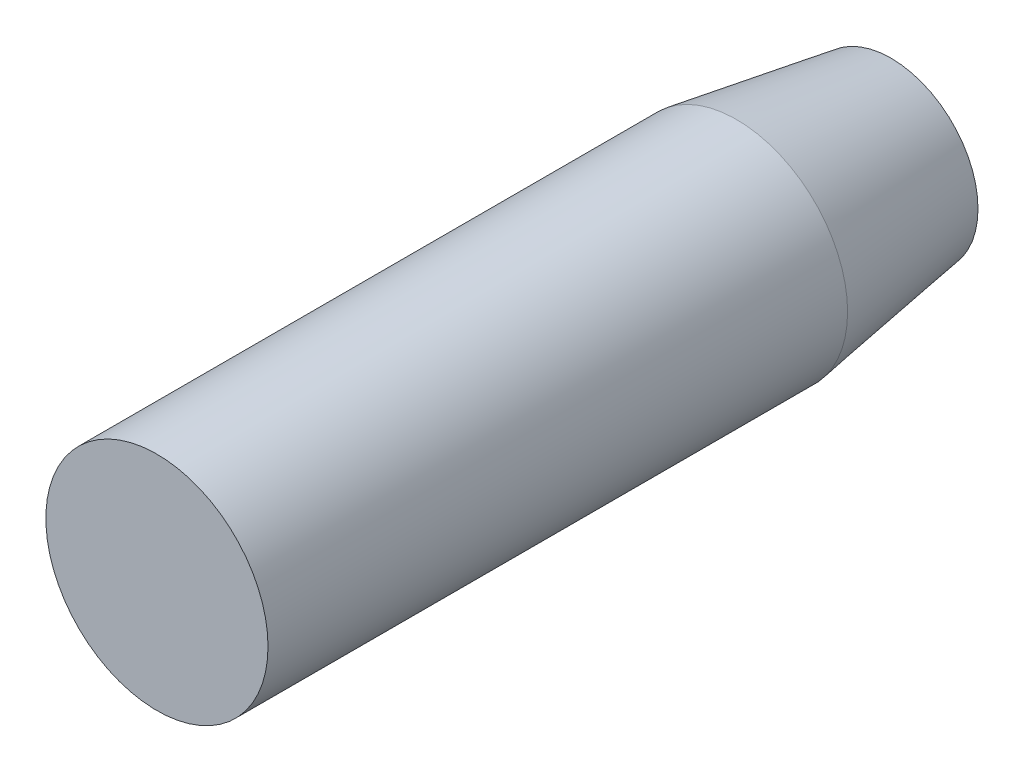
ISO-10303-21;
HEADER;
FILE_DESCRIPTION(('STEP AP214'),'2;1');
FILE_NAME('part.step','',(''),(''),'','','');
FILE_SCHEMA(('AUTOMOTIVE_DESIGN { 1 0 10303 214 1 1 1 1 }'));
ENDSEC;
DATA;
#1=APPLICATION_CONTEXT('core data for automotive mechanical design processes');
#2=APPLICATION_PROTOCOL_DEFINITION('international standard','automotive_design',2000,#1);
#3=PRODUCT_CONTEXT('',#1,'mechanical');
#4=PRODUCT('Part','Part','',(#3));
#5=PRODUCT_RELATED_PRODUCT_CATEGORY('part','',(#4));
#6=PRODUCT_DEFINITION_FORMATION('','',#4);
#7=PRODUCT_DEFINITION_CONTEXT('part definition',#1,'design');
#8=PRODUCT_DEFINITION('design','',#6,#7);
#9=PRODUCT_DEFINITION_SHAPE('','',#8);
#10=(LENGTH_UNIT() NAMED_UNIT(*) SI_UNIT(.MILLI.,.METRE.));
#11=(NAMED_UNIT(*) PLANE_ANGLE_UNIT() SI_UNIT($,.RADIAN.));
#12=(NAMED_UNIT(*) SI_UNIT($,.STERADIAN.) SOLID_ANGLE_UNIT());
#13=UNCERTAINTY_MEASURE_WITH_UNIT(LENGTH_MEASURE(1.E-05),#10,'distance_accuracy_value','');
#14=(GEOMETRIC_REPRESENTATION_CONTEXT(3) GLOBAL_UNCERTAINTY_ASSIGNED_CONTEXT((#13)) GLOBAL_UNIT_ASSIGNED_CONTEXT((#10,
#11,#12)) REPRESENTATION_CONTEXT('',''));
#15=CARTESIAN_POINT('',(0.,0.,0.));
#16=DIRECTION('',(0.,0.,1.));
#17=DIRECTION('',(1.,0.,0.));
#18=AXIS2_PLACEMENT_3D('',#15,#16,#17);
#19=CARTESIAN_POINT('',(-4.83870960531696,12.5960053959194,0.));
#20=DIRECTION('',(0.,0.,-1.));
#21=DIRECTION('',(-1.,0.,0.));
#22=AXIS2_PLACEMENT_3D('',#19,#20,#21);
#23=PLANE('',#22);
#24=CARTESIAN_POINT('',(-4.83870960531696,12.5960053959194,2.00880978518114E-12));
#25=DIRECTION('',(0.,0.,1.));
#26=DIRECTION('',(1.,0.,0.));
#27=AXIS2_PLACEMENT_3D('',#24,#25,#26);
#28=CIRCLE('',#27,14.2874999999872);
#29=CARTESIAN_POINT('',(9.44879039467024,12.5960053959194,2.00880978518114E-12));
#30=VERTEX_POINT('',#29);
#31=EDGE_CURVE('E18',#30,#30,#28,.T.);
#32=ORIENTED_EDGE('',*,*,#31,.F.);
#33=EDGE_LOOP('',(#32));
#34=FACE_BOUND('',#33,.T.);
#35=ADVANCED_FACE('F15',(#34),#23,.T.);
#36=CARTESIAN_POINT('',(-4.83870960531696,12.5960053959194,25.4));
#37=DIRECTION('',(0.,0.,1.));
#38=DIRECTION('',(1.,0.,0.));
#39=AXIS2_PLACEMENT_3D('',#36,#37,#38);
#40=CONICAL_SURFACE('',#39,18.25625,0.154996741924445);
#41=CARTESIAN_POINT('',(-4.83870960531696,12.5960053959194,25.4));
#42=DIRECTION('',(0.,0.,1.));
#43=DIRECTION('',(1.,0.,0.));
#44=AXIS2_PLACEMENT_3D('',#41,#42,#43);
#45=CIRCLE('',#44,18.25625);
#46=CARTESIAN_POINT('',(13.417540394683,12.5960053959194,25.4));
#47=VERTEX_POINT('',#46);
#48=EDGE_CURVE('E22',#47,#47,#45,.T.);
#49=ORIENTED_EDGE('',*,*,#48,.F.);
#50=EDGE_LOOP('',(#49));
#51=FACE_BOUND('',#50,.T.);
#52=ORIENTED_EDGE('',*,*,#31,.T.);
#53=EDGE_LOOP('',(#52));
#54=FACE_BOUND('',#53,.T.);
#55=ADVANCED_FACE('F34',(#51,#54),#40,.T.);
#56=CARTESIAN_POINT('',(-4.83870960531696,12.5960053959194,120.65));
#57=DIRECTION('',(0.,0.,-1.));
#58=DIRECTION('',(-1.,0.,0.));
#59=AXIS2_PLACEMENT_3D('',#56,#57,#58);
#60=PLANE('',#59);
#61=CARTESIAN_POINT('',(-4.83870960531696,12.5960053959194,120.65));
#62=DIRECTION('',(0.,0.,1.));
#63=DIRECTION('',(1.,0.,0.));
#64=AXIS2_PLACEMENT_3D('',#61,#62,#63);
#65=CIRCLE('',#64,18.25625);
#66=CARTESIAN_POINT('',(13.417540394683,12.5960053959194,120.65));
#67=VERTEX_POINT('',#66);
#68=EDGE_CURVE('E10',#67,#67,#65,.F.);
#69=ORIENTED_EDGE('',*,*,#68,.F.);
#70=EDGE_LOOP('',(#69));
#71=FACE_BOUND('',#70,.T.);
#72=ADVANCED_FACE('F41',(#71),#60,.F.);
#73=CARTESIAN_POINT('',(-4.83870960531696,12.5960053959194,0.));
#74=DIRECTION('',(0.,0.,1.));
#75=DIRECTION('',(1.,0.,0.));
#76=AXIS2_PLACEMENT_3D('',#73,#74,#75);
#77=CYLINDRICAL_SURFACE('',#76,18.25625);
#78=ORIENTED_EDGE('',*,*,#68,.T.);
#79=EDGE_LOOP('',(#78));
#80=FACE_BOUND('',#79,.T.);
#81=ORIENTED_EDGE('',*,*,#48,.T.);
#82=EDGE_LOOP('',(#81));
#83=FACE_BOUND('',#82,.T.);
#84=ADVANCED_FACE('F43',(#80,#83),#77,.T.);
#85=CLOSED_SHELL('',(#35,#55,#72,#84));
#86=MANIFOLD_SOLID_BREP('B1',#85);
#87=ADVANCED_BREP_SHAPE_REPRESENTATION('',(#18,#86),#14);
#88=SHAPE_DEFINITION_REPRESENTATION(#9,#87);
ENDSEC;
END-ISO-10303-21;
